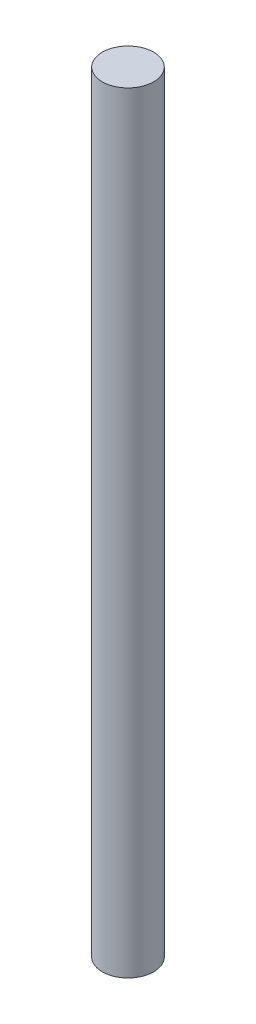
ISO-10303-21;
HEADER;
FILE_DESCRIPTION(('STEP AP214'),'2;1');
FILE_NAME('part.step','',(''),(''),'','','');
FILE_SCHEMA(('AUTOMOTIVE_DESIGN { 1 0 10303 214 1 1 1 1 }'));
ENDSEC;
DATA;
#1=APPLICATION_CONTEXT('core data for automotive mechanical design processes');
#2=APPLICATION_PROTOCOL_DEFINITION('international standard','automotive_design',2000,#1);
#3=PRODUCT_CONTEXT('',#1,'mechanical');
#4=PRODUCT('Part','Part','',(#3));
#5=PRODUCT_RELATED_PRODUCT_CATEGORY('part','',(#4));
#6=PRODUCT_DEFINITION_FORMATION('','',#4);
#7=PRODUCT_DEFINITION_CONTEXT('part definition',#1,'design');
#8=PRODUCT_DEFINITION('design','',#6,#7);
#9=PRODUCT_DEFINITION_SHAPE('','',#8);
#10=(LENGTH_UNIT() NAMED_UNIT(*) SI_UNIT(.MILLI.,.METRE.));
#11=(NAMED_UNIT(*) PLANE_ANGLE_UNIT() SI_UNIT($,.RADIAN.));
#12=(NAMED_UNIT(*) SI_UNIT($,.STERADIAN.) SOLID_ANGLE_UNIT());
#13=UNCERTAINTY_MEASURE_WITH_UNIT(LENGTH_MEASURE(1.E-05),#10,'distance_accuracy_value','');
#14=(GEOMETRIC_REPRESENTATION_CONTEXT(3) GLOBAL_UNCERTAINTY_ASSIGNED_CONTEXT((#13)) GLOBAL_UNIT_ASSIGNED_CONTEXT((#10,
#11,#12)) REPRESENTATION_CONTEXT('',''));
#15=CARTESIAN_POINT('',(0.,0.,0.));
#16=DIRECTION('',(0.,0.,1.));
#17=DIRECTION('',(1.,0.,0.));
#18=AXIS2_PLACEMENT_3D('',#15,#16,#17);
#19=CARTESIAN_POINT('',(0.,75.,0.));
#20=DIRECTION('',(0.,-1.,0.));
#21=DIRECTION('',(0.,0.,-1.));
#22=AXIS2_PLACEMENT_3D('',#19,#20,#21);
#23=CYLINDRICAL_SURFACE('',#22,2.5);
#24=CARTESIAN_POINT('',(0.,75.,0.));
#25=DIRECTION('',(0.,1.,0.));
#26=DIRECTION('',(0.,0.,1.));
#27=AXIS2_PLACEMENT_3D('',#24,#25,#26);
#28=CIRCLE('',#27,2.5);
#29=CARTESIAN_POINT('',(0.,75.,2.5));
#30=VERTEX_POINT('',#29);
#31=EDGE_CURVE('E10',#30,#30,#28,.T.);
#32=ORIENTED_EDGE('',*,*,#31,.F.);
#33=EDGE_LOOP('',(#32));
#34=FACE_BOUND('',#33,.T.);
#35=CARTESIAN_POINT('',(0.,0.,0.));
#36=DIRECTION('',(0.,1.,0.));
#37=DIRECTION('',(0.,0.,1.));
#38=AXIS2_PLACEMENT_3D('',#35,#36,#37);
#39=CIRCLE('',#38,2.5);
#40=CARTESIAN_POINT('',(0.,0.,2.5));
#41=VERTEX_POINT('',#40);
#42=EDGE_CURVE('E38',#41,#41,#39,.T.);
#43=ORIENTED_EDGE('',*,*,#42,.T.);
#44=EDGE_LOOP('',(#43));
#45=FACE_BOUND('',#44,.T.);
#46=ADVANCED_FACE('F35',(#34,#45),#23,.T.);
#47=CARTESIAN_POINT('',(0.,75.,0.));
#48=DIRECTION('',(0.,1.,0.));
#49=DIRECTION('',(0.,0.,1.));
#50=AXIS2_PLACEMENT_3D('',#47,#48,#49);
#51=PLANE('',#50);
#52=ORIENTED_EDGE('',*,*,#31,.T.);
#53=EDGE_LOOP('',(#52));
#54=FACE_BOUND('',#53,.T.);
#55=ADVANCED_FACE('F52',(#54),#51,.T.);
#56=CARTESIAN_POINT('',(0.,0.,0.));
#57=DIRECTION('',(0.,1.,0.));
#58=DIRECTION('',(0.,0.,1.));
#59=AXIS2_PLACEMENT_3D('',#56,#57,#58);
#60=PLANE('',#59);
#61=ORIENTED_EDGE('',*,*,#42,.F.);
#62=EDGE_LOOP('',(#61));
#63=FACE_BOUND('',#62,.T.);
#64=ADVANCED_FACE('F50',(#63),#60,.F.);
#65=CLOSED_SHELL('',(#46,#55,#64));
#66=MANIFOLD_SOLID_BREP('B2',#65);
#67=ADVANCED_BREP_SHAPE_REPRESENTATION('',(#18,#66),#14);
#68=SHAPE_DEFINITION_REPRESENTATION(#9,#67);
ENDSEC;
END-ISO-10303-21;
